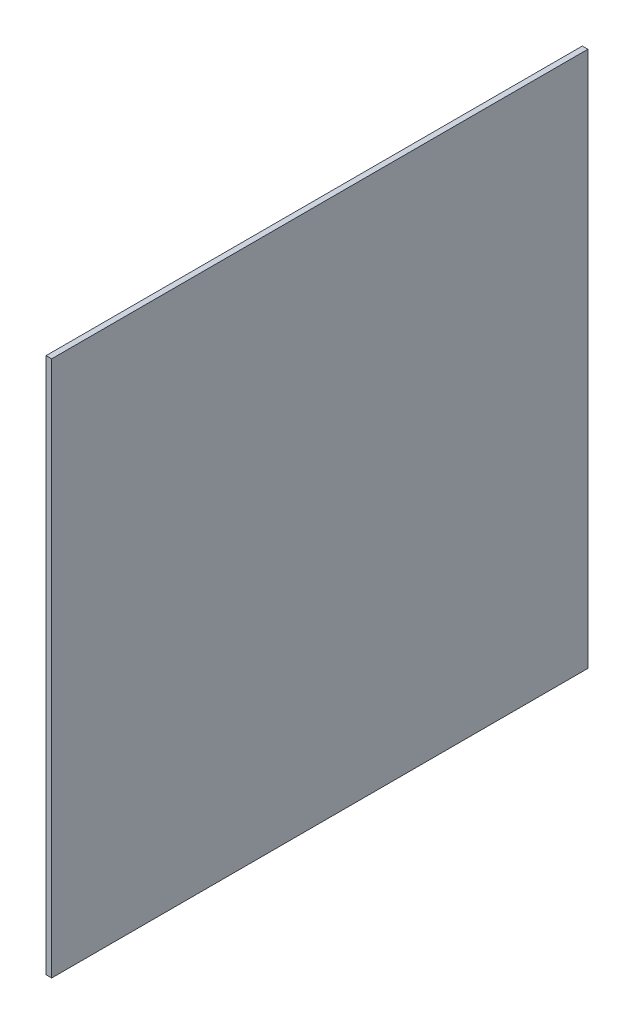
ISO-10303-21;
HEADER;
FILE_DESCRIPTION(('STEP AP214'),'2;1');
FILE_NAME('part.step','',(''),(''),'','','');
FILE_SCHEMA(('AUTOMOTIVE_DESIGN { 1 0 10303 214 1 1 1 1 }'));
ENDSEC;
DATA;
#1=APPLICATION_CONTEXT('core data for automotive mechanical design processes');
#2=APPLICATION_PROTOCOL_DEFINITION('international standard','automotive_design',2000,#1);
#3=PRODUCT_CONTEXT('',#1,'mechanical');
#4=PRODUCT('Part','Part','',(#3));
#5=PRODUCT_RELATED_PRODUCT_CATEGORY('part','',(#4));
#6=PRODUCT_DEFINITION_FORMATION('','',#4);
#7=PRODUCT_DEFINITION_CONTEXT('part definition',#1,'design');
#8=PRODUCT_DEFINITION('design','',#6,#7);
#9=PRODUCT_DEFINITION_SHAPE('','',#8);
#10=(LENGTH_UNIT() NAMED_UNIT(*) SI_UNIT(.MILLI.,.METRE.));
#11=(NAMED_UNIT(*) PLANE_ANGLE_UNIT() SI_UNIT($,.RADIAN.));
#12=(NAMED_UNIT(*) SI_UNIT($,.STERADIAN.) SOLID_ANGLE_UNIT());
#13=UNCERTAINTY_MEASURE_WITH_UNIT(LENGTH_MEASURE(1.E-05),#10,'distance_accuracy_value','');
#14=(GEOMETRIC_REPRESENTATION_CONTEXT(3) GLOBAL_UNCERTAINTY_ASSIGNED_CONTEXT((#13)) GLOBAL_UNIT_ASSIGNED_CONTEXT((#10,
#11,#12)) REPRESENTATION_CONTEXT('',''));
#15=CARTESIAN_POINT('',(0.,0.,0.));
#16=DIRECTION('',(0.,0.,1.));
#17=DIRECTION('',(1.,0.,0.));
#18=AXIS2_PLACEMENT_3D('',#15,#16,#17);
#19=CARTESIAN_POINT('',(3.175,152.4,152.4));
#20=DIRECTION('',(0.,0.,-1.));
#21=DIRECTION('',(-1.,0.,0.));
#22=AXIS2_PLACEMENT_3D('',#19,#20,#21);
#23=PLANE('',#22);
#24=DIRECTION('',(0.,-1.,0.));
#25=VECTOR('',#24,1.);
#26=CARTESIAN_POINT('',(0.,152.4,152.4));
#27=LINE('',#26,#25);
#28=CARTESIAN_POINT('',(0.,152.4,152.4));
#29=VERTEX_POINT('',#28);
#30=CARTESIAN_POINT('',(0.,-152.4,152.4));
#31=VERTEX_POINT('',#30);
#32=EDGE_CURVE('E107',#29,#31,#27,.T.);
#33=ORIENTED_EDGE('',*,*,#32,.T.);
#34=DIRECTION('',(-1.,0.,0.));
#35=VECTOR('',#34,1.);
#36=CARTESIAN_POINT('',(3.175,-152.4,152.4));
#37=LINE('',#36,#35);
#38=CARTESIAN_POINT('',(3.175,-152.4,152.4));
#39=VERTEX_POINT('',#38);
#40=EDGE_CURVE('E11',#39,#31,#37,.T.);
#41=ORIENTED_EDGE('',*,*,#40,.F.);
#42=DIRECTION('',(0.,-1.,0.));
#43=VECTOR('',#42,1.);
#44=CARTESIAN_POINT('',(3.175,152.4,152.4));
#45=LINE('',#44,#43);
#46=CARTESIAN_POINT('',(3.175,152.4,152.4));
#47=VERTEX_POINT('',#46);
#48=EDGE_CURVE('E91',#47,#39,#45,.T.);
#49=ORIENTED_EDGE('',*,*,#48,.F.);
#50=DIRECTION('',(-1.,0.,0.));
#51=VECTOR('',#50,1.);
#52=CARTESIAN_POINT('',(3.175,152.4,152.4));
#53=LINE('',#52,#51);
#54=EDGE_CURVE('E103',#47,#29,#53,.T.);
#55=ORIENTED_EDGE('',*,*,#54,.T.);
#56=EDGE_LOOP('',(#33,#41,#49,#55));
#57=FACE_BOUND('',#56,.T.);
#58=ADVANCED_FACE('F39',(#57),#23,.F.);
#59=CARTESIAN_POINT('',(3.175,-152.4,-152.4));
#60=DIRECTION('',(0.,1.,0.));
#61=DIRECTION('',(0.,0.,1.));
#62=AXIS2_PLACEMENT_3D('',#59,#60,#61);
#63=PLANE('',#62);
#64=DIRECTION('',(0.,0.,-1.));
#65=VECTOR('',#64,1.);
#66=CARTESIAN_POINT('',(0.,-152.4,-152.4));
#67=LINE('',#66,#65);
#68=CARTESIAN_POINT('',(0.,-152.4,-152.4));
#69=VERTEX_POINT('',#68);
#70=EDGE_CURVE('E96',#31,#69,#67,.T.);
#71=ORIENTED_EDGE('',*,*,#70,.T.);
#72=DIRECTION('',(-1.,0.,0.));
#73=VECTOR('',#72,1.);
#74=CARTESIAN_POINT('',(3.175,-152.4,-152.4));
#75=LINE('',#74,#73);
#76=CARTESIAN_POINT('',(3.175,-152.4,-152.4));
#77=VERTEX_POINT('',#76);
#78=EDGE_CURVE('E48',#77,#69,#75,.T.);
#79=ORIENTED_EDGE('',*,*,#78,.F.);
#80=DIRECTION('',(0.,0.,-1.));
#81=VECTOR('',#80,1.);
#82=CARTESIAN_POINT('',(3.175,-152.4,-152.4));
#83=LINE('',#82,#81);
#84=EDGE_CURVE('E86',#39,#77,#83,.T.);
#85=ORIENTED_EDGE('',*,*,#84,.F.);
#86=ORIENTED_EDGE('',*,*,#40,.T.);
#87=EDGE_LOOP('',(#71,#79,#85,#86));
#88=FACE_BOUND('',#87,.T.);
#89=ADVANCED_FACE('F95',(#88),#63,.F.);
#90=CARTESIAN_POINT('',(3.175,152.4,-152.4));
#91=DIRECTION('',(0.,0.,1.));
#92=DIRECTION('',(0.,-1.,0.));
#93=AXIS2_PLACEMENT_3D('',#90,#91,#92);
#94=PLANE('',#93);
#95=DIRECTION('',(0.,1.,0.));
#96=VECTOR('',#95,1.);
#97=CARTESIAN_POINT('',(0.,152.4,-152.4));
#98=LINE('',#97,#96);
#99=CARTESIAN_POINT('',(0.,152.4,-152.4));
#100=VERTEX_POINT('',#99);
#101=EDGE_CURVE('E73',#69,#100,#98,.T.);
#102=ORIENTED_EDGE('',*,*,#101,.T.);
#103=DIRECTION('',(-1.,0.,0.));
#104=VECTOR('',#103,1.);
#105=CARTESIAN_POINT('',(3.175,152.4,-152.4));
#106=LINE('',#105,#104);
#107=CARTESIAN_POINT('',(3.175,152.4,-152.4));
#108=VERTEX_POINT('',#107);
#109=EDGE_CURVE('E98',#108,#100,#106,.T.);
#110=ORIENTED_EDGE('',*,*,#109,.F.);
#111=DIRECTION('',(0.,1.,0.));
#112=VECTOR('',#111,1.);
#113=CARTESIAN_POINT('',(3.175,152.4,-152.4));
#114=LINE('',#113,#112);
#115=EDGE_CURVE('E89',#77,#108,#114,.T.);
#116=ORIENTED_EDGE('',*,*,#115,.F.);
#117=ORIENTED_EDGE('',*,*,#78,.T.);
#118=EDGE_LOOP('',(#102,#110,#116,#117));
#119=FACE_BOUND('',#118,.T.);
#120=ADVANCED_FACE('F99',(#119),#94,.F.);
#121=CARTESIAN_POINT('',(3.175,152.4,-152.4));
#122=DIRECTION('',(0.,-1.,0.));
#123=DIRECTION('',(0.,0.,-1.));
#124=AXIS2_PLACEMENT_3D('',#121,#122,#123);
#125=PLANE('',#124);
#126=DIRECTION('',(0.,0.,1.));
#127=VECTOR('',#126,1.);
#128=CARTESIAN_POINT('',(0.,152.4,-152.4));
#129=LINE('',#128,#127);
#130=EDGE_CURVE('E79',#100,#29,#129,.T.);
#131=ORIENTED_EDGE('',*,*,#130,.T.);
#132=ORIENTED_EDGE('',*,*,#54,.F.);
#133=DIRECTION('',(0.,0.,1.));
#134=VECTOR('',#133,1.);
#135=CARTESIAN_POINT('',(3.175,152.4,-152.4));
#136=LINE('',#135,#134);
#137=EDGE_CURVE('E56',#108,#47,#136,.T.);
#138=ORIENTED_EDGE('',*,*,#137,.F.);
#139=ORIENTED_EDGE('',*,*,#109,.T.);
#140=EDGE_LOOP('',(#131,#132,#138,#139));
#141=FACE_BOUND('',#140,.T.);
#142=ADVANCED_FACE('F120',(#141),#125,.F.);
#143=CARTESIAN_POINT('',(3.175,0.,0.));
#144=DIRECTION('',(-1.,0.,0.));
#145=DIRECTION('',(0.,0.,1.));
#146=AXIS2_PLACEMENT_3D('',#143,#144,#145);
#147=PLANE('',#146);
#148=ORIENTED_EDGE('',*,*,#48,.T.);
#149=ORIENTED_EDGE('',*,*,#84,.T.);
#150=ORIENTED_EDGE('',*,*,#115,.T.);
#151=ORIENTED_EDGE('',*,*,#137,.T.);
#152=EDGE_LOOP('',(#148,#149,#150,#151));
#153=FACE_BOUND('',#152,.T.);
#154=ADVANCED_FACE('F87',(#153),#147,.F.);
#155=CARTESIAN_POINT('',(0.,0.,0.));
#156=DIRECTION('',(-1.,0.,0.));
#157=DIRECTION('',(0.,0.,1.));
#158=AXIS2_PLACEMENT_3D('',#155,#156,#157);
#159=PLANE('',#158);
#160=ORIENTED_EDGE('',*,*,#32,.F.);
#161=ORIENTED_EDGE('',*,*,#130,.F.);
#162=ORIENTED_EDGE('',*,*,#101,.F.);
#163=ORIENTED_EDGE('',*,*,#70,.F.);
#164=EDGE_LOOP('',(#160,#161,#162,#163));
#165=FACE_BOUND('',#164,.T.);
#166=ADVANCED_FACE('F123',(#165),#159,.T.);
#167=CLOSED_SHELL('',(#58,#89,#120,#142,#154,#166));
#168=MANIFOLD_SOLID_BREP('B2',#167);
#169=ADVANCED_BREP_SHAPE_REPRESENTATION('',(#18,#168),#14);
#170=SHAPE_DEFINITION_REPRESENTATION(#9,#169);
ENDSEC;
END-ISO-10303-21;
